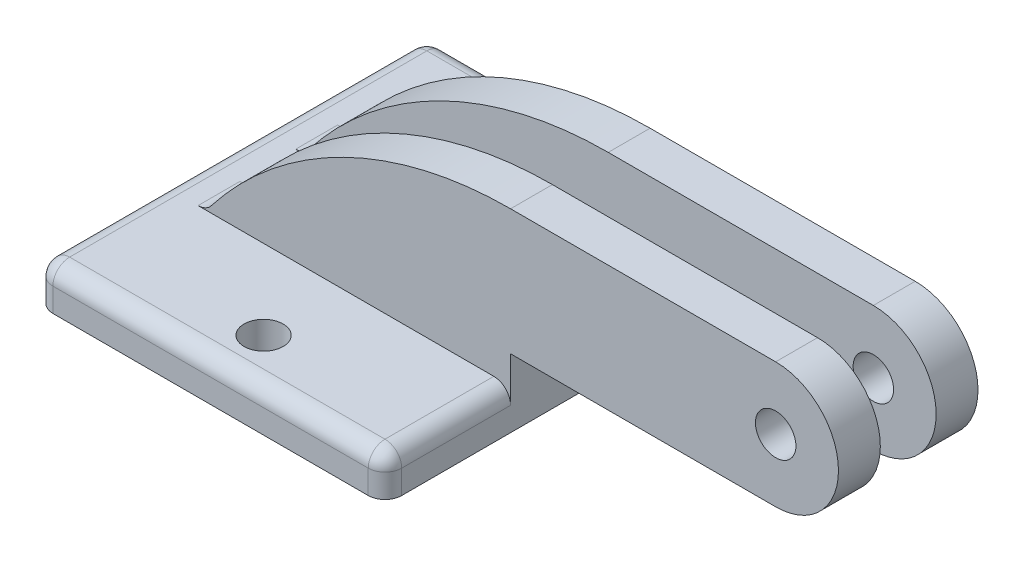
ISO-10303-21;
HEADER;
FILE_DESCRIPTION(('STEP AP214'),'2;1');
FILE_NAME('part.step','',(''),(''),'','','');
FILE_SCHEMA(('AUTOMOTIVE_DESIGN { 1 0 10303 214 1 1 1 1 }'));
ENDSEC;
DATA;
#1=APPLICATION_CONTEXT('core data for automotive mechanical design processes');
#2=APPLICATION_PROTOCOL_DEFINITION('international standard','automotive_design',2000,#1);
#3=PRODUCT_CONTEXT('',#1,'mechanical');
#4=PRODUCT('Part','Part','',(#3));
#5=PRODUCT_RELATED_PRODUCT_CATEGORY('part','',(#4));
#6=PRODUCT_DEFINITION_FORMATION('','',#4);
#7=PRODUCT_DEFINITION_CONTEXT('part definition',#1,'design');
#8=PRODUCT_DEFINITION('design','',#6,#7);
#9=PRODUCT_DEFINITION_SHAPE('','',#8);
#10=(LENGTH_UNIT() NAMED_UNIT(*) SI_UNIT(.MILLI.,.METRE.));
#11=(NAMED_UNIT(*) PLANE_ANGLE_UNIT() SI_UNIT($,.RADIAN.));
#12=(NAMED_UNIT(*) SI_UNIT($,.STERADIAN.) SOLID_ANGLE_UNIT());
#13=UNCERTAINTY_MEASURE_WITH_UNIT(LENGTH_MEASURE(1.E-05),#10,'distance_accuracy_value','');
#14=(GEOMETRIC_REPRESENTATION_CONTEXT(3) GLOBAL_UNCERTAINTY_ASSIGNED_CONTEXT((#13)) GLOBAL_UNIT_ASSIGNED_CONTEXT((#10,
#11,#12)) REPRESENTATION_CONTEXT('',''));
#15=CARTESIAN_POINT('',(0.,0.,0.));
#16=DIRECTION('',(0.,0.,1.));
#17=DIRECTION('',(1.,0.,0.));
#18=AXIS2_PLACEMENT_3D('',#15,#16,#17);
#19=CARTESIAN_POINT('',(7.9375,1.8415,-8.89));
#20=DIRECTION('',(-1.,0.,0.));
#21=DIRECTION('',(0.,0.,1.));
#22=AXIS2_PLACEMENT_3D('',#19,#20,#21);
#23=PLANE('',#22);
#24=DIRECTION('',(0.,0.,-1.));
#25=VECTOR('',#24,1.);
#26=CARTESIAN_POINT('',(7.9375,1.0795,-3.175));
#27=LINE('',#26,#25);
#28=CARTESIAN_POINT('',(7.9375,1.0795,-8.128));
#29=VERTEX_POINT('',#28);
#30=CARTESIAN_POINT('',(7.9375,1.0795,-3.175));
#31=VERTEX_POINT('',#30);
#32=EDGE_CURVE('E289',#29,#31,#27,.F.);
#33=ORIENTED_EDGE('',*,*,#32,.T.);
#34=DIRECTION('',(0.,1.,0.));
#35=VECTOR('',#34,1.);
#36=CARTESIAN_POINT('',(7.9375,0.,-3.175));
#37=LINE('',#36,#35);
#38=CARTESIAN_POINT('',(7.9375,3.1115,-3.175));
#39=VERTEX_POINT('',#38);
#40=EDGE_CURVE('E419',#31,#39,#37,.T.);
#41=ORIENTED_EDGE('',*,*,#40,.T.);
#42=DIRECTION('',(0.,0.,-1.));
#43=VECTOR('',#42,1.);
#44=CARTESIAN_POINT('',(7.9375,3.1115,3.175));
#45=LINE('',#44,#43);
#46=CARTESIAN_POINT('',(7.9375,3.1115,-1.27));
#47=VERTEX_POINT('',#46);
#48=EDGE_CURVE('E237',#47,#39,#45,.T.);
#49=ORIENTED_EDGE('',*,*,#48,.F.);
#50=DIRECTION('',(0.,1.,0.));
#51=VECTOR('',#50,1.);
#52=CARTESIAN_POINT('',(7.9375,0.,-1.27));
#53=LINE('',#52,#51);
#54=CARTESIAN_POINT('',(7.9375,1.8415,-1.27));
#55=VERTEX_POINT('',#54);
#56=EDGE_CURVE('E452',#55,#47,#53,.T.);
#57=ORIENTED_EDGE('',*,*,#56,.F.);
#58=DIRECTION('',(0.,0.,1.));
#59=VECTOR('',#58,1.);
#60=CARTESIAN_POINT('',(7.9375,1.8415,-1.27));
#61=LINE('',#60,#59);
#62=CARTESIAN_POINT('',(7.9375,1.8415,1.27));
#63=VERTEX_POINT('',#62);
#64=EDGE_CURVE('E387',#55,#63,#61,.T.);
#65=ORIENTED_EDGE('',*,*,#64,.T.);
#66=DIRECTION('',(0.,1.,0.));
#67=VECTOR('',#66,1.);
#68=CARTESIAN_POINT('',(7.9375,0.,1.27));
#69=LINE('',#68,#67);
#70=CARTESIAN_POINT('',(7.9375,3.1115,1.27));
#71=VERTEX_POINT('',#70);
#72=EDGE_CURVE('E378',#63,#71,#69,.T.);
#73=ORIENTED_EDGE('',*,*,#72,.T.);
#74=CARTESIAN_POINT('',(7.9375,3.1115,3.175));
#75=VERTEX_POINT('',#74);
#76=EDGE_CURVE('E232',#75,#71,#45,.T.);
#77=ORIENTED_EDGE('',*,*,#76,.F.);
#78=DIRECTION('',(0.,1.,0.));
#79=VECTOR('',#78,1.);
#80=CARTESIAN_POINT('',(7.9375,0.,3.175));
#81=LINE('',#80,#79);
#82=CARTESIAN_POINT('',(7.9375,1.0795,3.175));
#83=VERTEX_POINT('',#82);
#84=EDGE_CURVE('E404',#83,#75,#81,.T.);
#85=ORIENTED_EDGE('',*,*,#84,.F.);
#86=DIRECTION('',(0.,0.,-1.));
#87=VECTOR('',#86,1.);
#88=CARTESIAN_POINT('',(7.9375,1.0795,8.89));
#89=LINE('',#88,#87);
#90=CARTESIAN_POINT('',(7.9375,1.0795,8.128));
#91=VERTEX_POINT('',#90);
#92=EDGE_CURVE('E285',#83,#91,#89,.F.);
#93=ORIENTED_EDGE('',*,*,#92,.T.);
#94=DIRECTION('',(0.,-1.,0.));
#95=VECTOR('',#94,1.);
#96=CARTESIAN_POINT('',(7.9375,1.8415,8.128));
#97=LINE('',#96,#95);
#98=CARTESIAN_POINT('',(7.9375,0.,8.12799999999999));
#99=VERTEX_POINT('',#98);
#100=EDGE_CURVE('E283',#91,#99,#97,.T.);
#101=ORIENTED_EDGE('',*,*,#100,.T.);
#102=DIRECTION('',(0.,0.,-1.));
#103=VECTOR('',#102,1.);
#104=CARTESIAN_POINT('',(7.9375,0.,-8.89));
#105=LINE('',#104,#103);
#106=CARTESIAN_POINT('',(7.9375,0.,-8.128));
#107=VERTEX_POINT('',#106);
#108=EDGE_CURVE('E257',#99,#107,#105,.T.);
#109=ORIENTED_EDGE('',*,*,#108,.T.);
#110=DIRECTION('',(0.,-1.,0.));
#111=VECTOR('',#110,1.);
#112=CARTESIAN_POINT('',(7.9375,1.8415,-8.128));
#113=LINE('',#112,#111);
#114=EDGE_CURVE('E287',#107,#29,#113,.F.);
#115=ORIENTED_EDGE('',*,*,#114,.T.);
#116=EDGE_LOOP('',(#33,#41,#49,#57,#65,#73,#77,#85,#93,#101,#109,#115));
#117=FACE_BOUND('',#116,.T.);
#118=ADVANCED_FACE('F36',(#117),#23,.F.);
#119=CARTESIAN_POINT('',(0.,8.8265,3.175));
#120=DIRECTION('',(0.,-1.,0.));
#121=DIRECTION('',(1.,0.,0.));
#122=AXIS2_PLACEMENT_3D('',#119,#120,#121);
#123=PLANE('',#122);
#124=DIRECTION('',(-1.,0.,0.));
#125=VECTOR('',#124,1.);
#126=CARTESIAN_POINT('',(0.,8.8265,-1.27));
#127=LINE('',#126,#125);
#128=CARTESIAN_POINT('',(20.0025,8.8265,-1.27));
#129=VERTEX_POINT('',#128);
#130=CARTESIAN_POINT('',(7.9375,8.8265,-1.27));
#131=VERTEX_POINT('',#130);
#132=EDGE_CURVE('E205',#129,#131,#127,.T.);
#133=ORIENTED_EDGE('',*,*,#132,.F.);
#134=DIRECTION('',(0.,0.,-1.));
#135=VECTOR('',#134,1.);
#136=CARTESIAN_POINT('',(20.0025,8.8265,3.175));
#137=LINE('',#136,#135);
#138=CARTESIAN_POINT('',(20.0025,8.8265,-3.175));
#139=VERTEX_POINT('',#138);
#140=EDGE_CURVE('E410',#129,#139,#137,.T.);
#141=ORIENTED_EDGE('',*,*,#140,.T.);
#142=DIRECTION('',(-1.,0.,0.));
#143=VECTOR('',#142,1.);
#144=CARTESIAN_POINT('',(0.,8.8265,-3.175));
#145=LINE('',#144,#143);
#146=CARTESIAN_POINT('',(7.9375,8.8265,-3.175));
#147=VERTEX_POINT('',#146);
#148=EDGE_CURVE('E230',#139,#147,#145,.T.);
#149=ORIENTED_EDGE('',*,*,#148,.T.);
#150=DIRECTION('',(0.,0.,-1.));
#151=VECTOR('',#150,1.);
#152=CARTESIAN_POINT('',(7.9375,8.8265,3.175));
#153=LINE('',#152,#151);
#154=EDGE_CURVE('E221',#131,#147,#153,.T.);
#155=ORIENTED_EDGE('',*,*,#154,.F.);
#156=EDGE_LOOP('',(#133,#141,#149,#155));
#157=FACE_BOUND('',#156,.T.);
#158=ADVANCED_FACE('F228',(#157),#123,.F.);
#159=CARTESIAN_POINT('',(7.9375,-8.38315454545456,3.175));
#160=DIRECTION('',(0.,0.,-1.));
#161=DIRECTION('',(-1.,0.,0.));
#162=AXIS2_PLACEMENT_3D('',#159,#160,#161);
#163=CYLINDRICAL_SURFACE('',#162,17.2096545454546);
#164=CARTESIAN_POINT('',(7.9375,-8.38315454545456,-3.175));
#165=DIRECTION('',(0.,0.,1.));
#166=DIRECTION('',(1.,0.,0.));
#167=AXIS2_PLACEMENT_3D('',#164,#165,#166);
#168=CIRCLE('',#167,17.2096545454546);
#169=CARTESIAN_POINT('',(-5.68177206572116,2.13766471797507,-3.175));
#170=VERTEX_POINT('',#169);
#171=EDGE_CURVE('E414',#147,#170,#168,.T.);
#172=ORIENTED_EDGE('',*,*,#171,.T.);
#173=DIRECTION('',(0.,0.,-1.));
#174=VECTOR('',#173,1.);
#175=CARTESIAN_POINT('',(-5.68177206572116,2.13766471797508,3.175));
#176=LINE('',#175,#174);
#177=CARTESIAN_POINT('',(-5.68177206572116,2.13766471797507,-1.27));
#178=VERTEX_POINT('',#177);
#179=EDGE_CURVE('E224',#170,#178,#176,.F.);
#180=ORIENTED_EDGE('',*,*,#179,.T.);
#181=CARTESIAN_POINT('',(7.9375,-8.38315454545456,-1.27));
#182=DIRECTION('',(0.,0.,1.));
#183=DIRECTION('',(1.,0.,0.));
#184=AXIS2_PLACEMENT_3D('',#181,#182,#183);
#185=CIRCLE('',#184,17.2096545454546);
#186=EDGE_CURVE('E209',#131,#178,#185,.T.);
#187=ORIENTED_EDGE('',*,*,#186,.F.);
#188=ORIENTED_EDGE('',*,*,#154,.T.);
#189=EDGE_LOOP('',(#172,#180,#187,#188));
#190=FACE_BOUND('',#189,.T.);
#191=ADVANCED_FACE('F220',(#190),#163,.T.);
#192=CARTESIAN_POINT('',(0.,3.1115,3.175));
#193=DIRECTION('',(0.,1.,0.));
#194=DIRECTION('',(0.,0.,1.));
#195=AXIS2_PLACEMENT_3D('',#192,#193,#194);
#196=PLANE('',#195);
#197=DIRECTION('',(1.,0.,0.));
#198=VECTOR('',#197,1.);
#199=CARTESIAN_POINT('',(0.,3.1115,-1.27));
#200=LINE('',#199,#198);
#201=CARTESIAN_POINT('',(20.0025,3.1115,-1.27));
#202=VERTEX_POINT('',#201);
#203=EDGE_CURVE('E456',#47,#202,#200,.T.);
#204=ORIENTED_EDGE('',*,*,#203,.F.);
#205=ORIENTED_EDGE('',*,*,#48,.T.);
#206=DIRECTION('',(1.,0.,0.));
#207=VECTOR('',#206,1.);
#208=CARTESIAN_POINT('',(0.,3.1115,-3.175));
#209=LINE('',#208,#207);
#210=CARTESIAN_POINT('',(20.0025,3.1115,-3.175));
#211=VERTEX_POINT('',#210);
#212=EDGE_CURVE('E422',#39,#211,#209,.T.);
#213=ORIENTED_EDGE('',*,*,#212,.T.);
#214=DIRECTION('',(0.,0.,-1.));
#215=VECTOR('',#214,1.);
#216=CARTESIAN_POINT('',(20.0025,3.1115,3.175));
#217=LINE('',#216,#215);
#218=EDGE_CURVE('E429',#202,#211,#217,.T.);
#219=ORIENTED_EDGE('',*,*,#218,.F.);
#220=EDGE_LOOP('',(#204,#205,#213,#219));
#221=FACE_BOUND('',#220,.T.);
#222=ADVANCED_FACE('F442',(#221),#196,.F.);
#223=CARTESIAN_POINT('',(20.0025,5.969,3.175));
#224=DIRECTION('',(0.,0.,-1.));
#225=DIRECTION('',(-1.,0.,0.));
#226=AXIS2_PLACEMENT_3D('',#223,#224,#225);
#227=CYLINDRICAL_SURFACE('',#226,0.92075);
#228=CARTESIAN_POINT('',(20.0025,5.969,-3.175));
#229=DIRECTION('',(0.,0.,1.));
#230=DIRECTION('',(1.,0.,0.));
#231=AXIS2_PLACEMENT_3D('',#228,#229,#230);
#232=CIRCLE('',#231,0.92075);
#233=CARTESIAN_POINT('',(20.92325,5.969,-3.175));
#234=VERTEX_POINT('',#233);
#235=EDGE_CURVE('E390',#234,#234,#232,.T.);
#236=ORIENTED_EDGE('',*,*,#235,.F.);
#237=EDGE_LOOP('',(#236));
#238=FACE_BOUND('',#237,.T.);
#239=CARTESIAN_POINT('',(20.0025,5.969,-1.27));
#240=DIRECTION('',(0.,0.,1.));
#241=DIRECTION('',(1.,0.,0.));
#242=AXIS2_PLACEMENT_3D('',#239,#240,#241);
#243=CIRCLE('',#242,0.92075);
#244=CARTESIAN_POINT('',(20.92325,5.969,-1.27));
#245=VERTEX_POINT('',#244);
#246=EDGE_CURVE('E216',#245,#245,#243,.T.);
#247=ORIENTED_EDGE('',*,*,#246,.T.);
#248=EDGE_LOOP('',(#247));
#249=FACE_BOUND('',#248,.T.);
#250=ADVANCED_FACE('F462',(#238,#249),#227,.F.);
#251=CARTESIAN_POINT('',(20.0025,5.969,3.175));
#252=DIRECTION('',(0.,0.,-1.));
#253=DIRECTION('',(-1.,0.,0.));
#254=AXIS2_PLACEMENT_3D('',#251,#252,#253);
#255=CYLINDRICAL_SURFACE('',#254,2.8575);
#256=CARTESIAN_POINT('',(20.0025,5.969,-1.27));
#257=DIRECTION('',(0.,0.,1.));
#258=DIRECTION('',(1.,0.,0.));
#259=AXIS2_PLACEMENT_3D('',#256,#257,#258);
#260=CIRCLE('',#259,2.8575);
#261=EDGE_CURVE('E212',#202,#129,#260,.T.);
#262=ORIENTED_EDGE('',*,*,#261,.F.);
#263=ORIENTED_EDGE('',*,*,#218,.T.);
#264=CARTESIAN_POINT('',(20.0025,5.969,-3.175));
#265=DIRECTION('',(0.,0.,1.));
#266=DIRECTION('',(1.,0.,0.));
#267=AXIS2_PLACEMENT_3D('',#264,#265,#266);
#268=CIRCLE('',#267,2.8575);
#269=EDGE_CURVE('E395',#211,#139,#268,.T.);
#270=ORIENTED_EDGE('',*,*,#269,.T.);
#271=ORIENTED_EDGE('',*,*,#140,.F.);
#272=EDGE_LOOP('',(#262,#263,#270,#271));
#273=FACE_BOUND('',#272,.T.);
#274=ADVANCED_FACE('F437',(#273),#255,.T.);
#275=CARTESIAN_POINT('',(0.,1.8415,0.));
#276=DIRECTION('',(0.,1.,0.));
#277=DIRECTION('',(0.,0.,1.));
#278=AXIS2_PLACEMENT_3D('',#275,#276,#277);
#279=PLANE('',#278);
#280=CARTESIAN_POINT('',(0.317500000000003,1.8415,-6.7945));
#281=DIRECTION('',(0.,1.,0.));
#282=DIRECTION('',(0.,0.,1.));
#283=AXIS2_PLACEMENT_3D('',#280,#281,#282);
#284=CIRCLE('',#283,0.889);
#285=CARTESIAN_POINT('',(0.317500000000003,1.8415,-5.9055));
#286=VERTEX_POINT('',#285);
#287=EDGE_CURVE('E247',#286,#286,#284,.T.);
#288=ORIENTED_EDGE('',*,*,#287,.F.);
#289=EDGE_LOOP('',(#288));
#290=FACE_BOUND('',#289,.T.);
#291=CARTESIAN_POINT('',(0.317500000000003,1.8415,6.7945));
#292=DIRECTION('',(0.,1.,0.));
#293=DIRECTION('',(0.,0.,1.));
#294=AXIS2_PLACEMENT_3D('',#291,#292,#293);
#295=CIRCLE('',#294,0.889);
#296=CARTESIAN_POINT('',(0.317500000000003,1.8415,7.6835));
#297=VERTEX_POINT('',#296);
#298=EDGE_CURVE('E241',#297,#297,#295,.T.);
#299=ORIENTED_EDGE('',*,*,#298,.F.);
#300=EDGE_LOOP('',(#299));
#301=FACE_BOUND('',#300,.T.);
#302=DIRECTION('',(0.,0.,-1.));
#303=VECTOR('',#302,1.);
#304=CARTESIAN_POINT('',(-6.28479900543509,1.8415,0.));
#305=LINE('',#304,#303);
#306=CARTESIAN_POINT('',(-6.28479900543509,1.8415,-1.27));
#307=VERTEX_POINT('',#306);
#308=CARTESIAN_POINT('',(-6.28479900543509,1.8415,-3.175));
#309=VERTEX_POINT('',#308);
#310=EDGE_CURVE('E277',#307,#309,#305,.T.);
#311=ORIENTED_EDGE('',*,*,#310,.T.);
#312=DIRECTION('',(1.,0.,0.));
#313=VECTOR('',#312,1.);
#314=CARTESIAN_POINT('',(0.,1.8415,-3.175));
#315=LINE('',#314,#313);
#316=CARTESIAN_POINT('',(7.1755,1.8415,-3.175));
#317=VERTEX_POINT('',#316);
#318=EDGE_CURVE('E416',#309,#317,#315,.T.);
#319=ORIENTED_EDGE('',*,*,#318,.T.);
#320=DIRECTION('',(0.,0.,-1.));
#321=VECTOR('',#320,1.);
#322=CARTESIAN_POINT('',(7.1755,1.8415,-8.89));
#323=LINE('',#322,#321);
#324=CARTESIAN_POINT('',(7.1755,1.8415,-8.128));
#325=VERTEX_POINT('',#324);
#326=EDGE_CURVE('E269',#317,#325,#323,.T.);
#327=ORIENTED_EDGE('',*,*,#326,.T.);
#328=DIRECTION('',(-1.,0.,0.));
#329=VECTOR('',#328,1.);
#330=CARTESIAN_POINT('',(-7.9375,1.8415,-8.128));
#331=LINE('',#330,#329);
#332=CARTESIAN_POINT('',(-7.1755,1.8415,-8.128));
#333=VERTEX_POINT('',#332);
#334=EDGE_CURVE('E267',#325,#333,#331,.T.);
#335=ORIENTED_EDGE('',*,*,#334,.T.);
#336=DIRECTION('',(0.,0.,1.));
#337=VECTOR('',#336,1.);
#338=CARTESIAN_POINT('',(-7.1755,1.8415,8.89));
#339=LINE('',#338,#337);
#340=CARTESIAN_POINT('',(-7.1755,1.8415,8.128));
#341=VERTEX_POINT('',#340);
#342=EDGE_CURVE('E263',#333,#341,#339,.T.);
#343=ORIENTED_EDGE('',*,*,#342,.T.);
#344=DIRECTION('',(1.,0.,0.));
#345=VECTOR('',#344,1.);
#346=CARTESIAN_POINT('',(7.9375,1.8415,8.128));
#347=LINE('',#346,#345);
#348=CARTESIAN_POINT('',(7.1755,1.8415,8.128));
#349=VERTEX_POINT('',#348);
#350=EDGE_CURVE('E265',#341,#349,#347,.T.);
#351=ORIENTED_EDGE('',*,*,#350,.T.);
#352=DIRECTION('',(0.,0.,-1.));
#353=VECTOR('',#352,1.);
#354=CARTESIAN_POINT('',(7.1755,1.8415,3.175));
#355=LINE('',#354,#353);
#356=CARTESIAN_POINT('',(7.1755,1.8415,3.175));
#357=VERTEX_POINT('',#356);
#358=EDGE_CURVE('E272',#349,#357,#355,.T.);
#359=ORIENTED_EDGE('',*,*,#358,.T.);
#360=DIRECTION('',(1.,0.,0.));
#361=VECTOR('',#360,1.);
#362=CARTESIAN_POINT('',(0.,1.8415,3.175));
#363=LINE('',#362,#361);
#364=CARTESIAN_POINT('',(-6.28479900543509,1.8415,3.175));
#365=VERTEX_POINT('',#364);
#366=EDGE_CURVE('E401',#365,#357,#363,.T.);
#367=ORIENTED_EDGE('',*,*,#366,.F.);
#368=DIRECTION('',(0.,0.,-1.));
#369=VECTOR('',#368,1.);
#370=CARTESIAN_POINT('',(-6.28479900543509,1.8415,0.));
#371=LINE('',#370,#369);
#372=CARTESIAN_POINT('',(-6.28479900543509,1.8415,1.27));
#373=VERTEX_POINT('',#372);
#374=EDGE_CURVE('E274',#365,#373,#371,.T.);
#375=ORIENTED_EDGE('',*,*,#374,.T.);
#376=DIRECTION('',(1.,0.,0.));
#377=VECTOR('',#376,1.);
#378=CARTESIAN_POINT('',(0.,1.8415,1.27));
#379=LINE('',#378,#377);
#380=EDGE_CURVE('E375',#373,#63,#379,.T.);
#381=ORIENTED_EDGE('',*,*,#380,.T.);
#382=ORIENTED_EDGE('',*,*,#64,.F.);
#383=DIRECTION('',(1.,0.,0.));
#384=VECTOR('',#383,1.);
#385=CARTESIAN_POINT('',(0.,1.8415,-1.27));
#386=LINE('',#385,#384);
#387=EDGE_CURVE('E225',#307,#55,#386,.T.);
#388=ORIENTED_EDGE('',*,*,#387,.F.);
#389=EDGE_LOOP('',(#311,#319,#327,#335,#343,#351,#359,#367,#375,#381,#382,#388));
#390=FACE_BOUND('',#389,.T.);
#391=ADVANCED_FACE('F586',(#290,#301,#390),#279,.T.);
#392=CARTESIAN_POINT('',(0.,0.,0.));
#393=DIRECTION('',(0.,1.,0.));
#394=DIRECTION('',(0.,0.,1.));
#395=AXIS2_PLACEMENT_3D('',#392,#393,#394);
#396=PLANE('',#395);
#397=DIRECTION('',(-1.,0.,0.));
#398=VECTOR('',#397,1.);
#399=CARTESIAN_POINT('',(-7.9375,0.,-8.89));
#400=LINE('',#399,#398);
#401=CARTESIAN_POINT('',(7.1755,0.,-8.89));
#402=VERTEX_POINT('',#401);
#403=CARTESIAN_POINT('',(-7.1755,0.,-8.89));
#404=VERTEX_POINT('',#403);
#405=EDGE_CURVE('E260',#402,#404,#400,.T.);
#406=ORIENTED_EDGE('',*,*,#405,.F.);
#407=CARTESIAN_POINT('',(7.1755,0.,-8.128));
#408=DIRECTION('',(0.,1.,0.));
#409=DIRECTION('',(0.,0.,1.));
#410=AXIS2_PLACEMENT_3D('',#407,#408,#409);
#411=CIRCLE('',#410,0.762);
#412=EDGE_CURVE('E314',#402,#107,#411,.F.);
#413=ORIENTED_EDGE('',*,*,#412,.T.);
#414=ORIENTED_EDGE('',*,*,#108,.F.);
#415=CARTESIAN_POINT('',(7.1755,0.,8.128));
#416=DIRECTION('',(0.,1.,0.));
#417=DIRECTION('',(0.,0.,1.));
#418=AXIS2_PLACEMENT_3D('',#415,#416,#417);
#419=CIRCLE('',#418,0.762);
#420=CARTESIAN_POINT('',(7.1755,0.,8.89));
#421=VERTEX_POINT('',#420);
#422=EDGE_CURVE('E310',#99,#421,#419,.F.);
#423=ORIENTED_EDGE('',*,*,#422,.T.);
#424=DIRECTION('',(1.,0.,0.));
#425=VECTOR('',#424,1.);
#426=CARTESIAN_POINT('',(-7.9375,0.,8.89));
#427=LINE('',#426,#425);
#428=CARTESIAN_POINT('',(-7.1755,0.,8.89));
#429=VERTEX_POINT('',#428);
#430=EDGE_CURVE('E254',#429,#421,#427,.T.);
#431=ORIENTED_EDGE('',*,*,#430,.F.);
#432=CARTESIAN_POINT('',(-7.1755,0.,8.128));
#433=DIRECTION('',(0.,1.,0.));
#434=DIRECTION('',(0.,0.,1.));
#435=AXIS2_PLACEMENT_3D('',#432,#433,#434);
#436=CIRCLE('',#435,0.762);
#437=CARTESIAN_POINT('',(-7.9375,0.,8.128));
#438=VERTEX_POINT('',#437);
#439=EDGE_CURVE('E308',#429,#438,#436,.F.);
#440=ORIENTED_EDGE('',*,*,#439,.T.);
#441=DIRECTION('',(0.,0.,1.));
#442=VECTOR('',#441,1.);
#443=CARTESIAN_POINT('',(-7.9375,0.,-8.89));
#444=LINE('',#443,#442);
#445=CARTESIAN_POINT('',(-7.9375,0.,-8.128));
#446=VERTEX_POINT('',#445);
#447=EDGE_CURVE('E250',#446,#438,#444,.T.);
#448=ORIENTED_EDGE('',*,*,#447,.F.);
#449=CARTESIAN_POINT('',(-7.1755,0.,-8.128));
#450=DIRECTION('',(0.,1.,0.));
#451=DIRECTION('',(0.,0.,1.));
#452=AXIS2_PLACEMENT_3D('',#449,#450,#451);
#453=CIRCLE('',#452,0.762);
#454=EDGE_CURVE('E312',#446,#404,#453,.F.);
#455=ORIENTED_EDGE('',*,*,#454,.T.);
#456=EDGE_LOOP('',(#406,#413,#414,#423,#431,#440,#448,#455));
#457=FACE_BOUND('',#456,.T.);
#458=CARTESIAN_POINT('',(0.317500000000003,0.,-6.7945));
#459=DIRECTION('',(0.,1.,0.));
#460=DIRECTION('',(0.,0.,1.));
#461=AXIS2_PLACEMENT_3D('',#458,#459,#460);
#462=CIRCLE('',#461,0.889);
#463=CARTESIAN_POINT('',(0.317500000000003,0.,-5.9055));
#464=VERTEX_POINT('',#463);
#465=EDGE_CURVE('E244',#464,#464,#462,.T.);
#466=ORIENTED_EDGE('',*,*,#465,.T.);
#467=EDGE_LOOP('',(#466));
#468=FACE_BOUND('',#467,.T.);
#469=CARTESIAN_POINT('',(0.317500000000003,0.,6.7945));
#470=DIRECTION('',(0.,1.,0.));
#471=DIRECTION('',(0.,0.,1.));
#472=AXIS2_PLACEMENT_3D('',#469,#470,#471);
#473=CIRCLE('',#472,0.889);
#474=CARTESIAN_POINT('',(0.317500000000003,0.,7.6835));
#475=VERTEX_POINT('',#474);
#476=EDGE_CURVE('E235',#475,#475,#473,.T.);
#477=ORIENTED_EDGE('',*,*,#476,.T.);
#478=EDGE_LOOP('',(#477));
#479=FACE_BOUND('',#478,.T.);
#480=ADVANCED_FACE('F493',(#457,#468,#479),#396,.F.);
#481=CARTESIAN_POINT('',(-7.9375,1.8415,-8.89));
#482=DIRECTION('',(1.,0.,0.));
#483=DIRECTION('',(0.,0.,-1.));
#484=AXIS2_PLACEMENT_3D('',#481,#482,#483);
#485=PLANE('',#484);
#486=DIRECTION('',(0.,0.,1.));
#487=VECTOR('',#486,1.);
#488=CARTESIAN_POINT('',(-7.9375,1.0795,-8.89));
#489=LINE('',#488,#487);
#490=CARTESIAN_POINT('',(-7.9375,1.0795,8.128));
#491=VERTEX_POINT('',#490);
#492=CARTESIAN_POINT('',(-7.9375,1.0795,-8.128));
#493=VERTEX_POINT('',#492);
#494=EDGE_CURVE('E53',#491,#493,#489,.F.);
#495=ORIENTED_EDGE('',*,*,#494,.T.);
#496=DIRECTION('',(0.,-1.,0.));
#497=VECTOR('',#496,1.);
#498=CARTESIAN_POINT('',(-7.9375,1.8415,-8.128));
#499=LINE('',#498,#497);
#500=EDGE_CURVE('E306',#493,#446,#499,.T.);
#501=ORIENTED_EDGE('',*,*,#500,.T.);
#502=ORIENTED_EDGE('',*,*,#447,.T.);
#503=DIRECTION('',(0.,-1.,0.));
#504=VECTOR('',#503,1.);
#505=CARTESIAN_POINT('',(-7.9375,1.8415,8.128));
#506=LINE('',#505,#504);
#507=EDGE_CURVE('E58',#438,#491,#506,.F.);
#508=ORIENTED_EDGE('',*,*,#507,.T.);
#509=EDGE_LOOP('',(#495,#501,#502,#508));
#510=FACE_BOUND('',#509,.T.);
#511=ADVANCED_FACE('F489',(#510),#485,.F.);
#512=CARTESIAN_POINT('',(-7.9375,1.8415,8.89));
#513=DIRECTION('',(0.,0.,-1.));
#514=DIRECTION('',(-1.,0.,0.));
#515=AXIS2_PLACEMENT_3D('',#512,#513,#514);
#516=PLANE('',#515);
#517=ORIENTED_EDGE('',*,*,#430,.T.);
#518=DIRECTION('',(0.,-1.,0.));
#519=VECTOR('',#518,1.);
#520=CARTESIAN_POINT('',(7.1755,1.8415,8.89));
#521=LINE('',#520,#519);
#522=CARTESIAN_POINT('',(7.1755,1.0795,8.89));
#523=VERTEX_POINT('',#522);
#524=EDGE_CURVE('E302',#421,#523,#521,.F.);
#525=ORIENTED_EDGE('',*,*,#524,.T.);
#526=DIRECTION('',(1.,0.,0.));
#527=VECTOR('',#526,1.);
#528=CARTESIAN_POINT('',(-7.9375,1.0795,8.89));
#529=LINE('',#528,#527);
#530=CARTESIAN_POINT('',(-7.1755,1.0795,8.89));
#531=VERTEX_POINT('',#530);
#532=EDGE_CURVE('E300',#523,#531,#529,.F.);
#533=ORIENTED_EDGE('',*,*,#532,.T.);
#534=DIRECTION('',(0.,-1.,0.));
#535=VECTOR('',#534,1.);
#536=CARTESIAN_POINT('',(-7.1755,1.8415,8.89));
#537=LINE('',#536,#535);
#538=EDGE_CURVE('E298',#531,#429,#537,.T.);
#539=ORIENTED_EDGE('',*,*,#538,.T.);
#540=EDGE_LOOP('',(#517,#525,#533,#539));
#541=FACE_BOUND('',#540,.T.);
#542=ADVANCED_FACE('F486',(#541),#516,.F.);
#543=CARTESIAN_POINT('',(-7.9375,1.8415,-8.89));
#544=DIRECTION('',(0.,0.,1.));
#545=DIRECTION('',(1.,0.,0.));
#546=AXIS2_PLACEMENT_3D('',#543,#544,#545);
#547=PLANE('',#546);
#548=DIRECTION('',(-1.,0.,0.));
#549=VECTOR('',#548,1.);
#550=CARTESIAN_POINT('',(7.9375,1.0795,-8.89));
#551=LINE('',#550,#549);
#552=CARTESIAN_POINT('',(-7.1755,1.0795,-8.89));
#553=VERTEX_POINT('',#552);
#554=CARTESIAN_POINT('',(7.1755,1.0795,-8.89));
#555=VERTEX_POINT('',#554);
#556=EDGE_CURVE('E294',#553,#555,#551,.F.);
#557=ORIENTED_EDGE('',*,*,#556,.T.);
#558=DIRECTION('',(0.,-1.,0.));
#559=VECTOR('',#558,1.);
#560=CARTESIAN_POINT('',(7.1755,1.8415,-8.89));
#561=LINE('',#560,#559);
#562=EDGE_CURVE('E296',#555,#402,#561,.T.);
#563=ORIENTED_EDGE('',*,*,#562,.T.);
#564=ORIENTED_EDGE('',*,*,#405,.T.);
#565=DIRECTION('',(0.,-1.,0.));
#566=VECTOR('',#565,1.);
#567=CARTESIAN_POINT('',(-7.1755,1.8415,-8.89));
#568=LINE('',#567,#566);
#569=EDGE_CURVE('E292',#404,#553,#568,.F.);
#570=ORIENTED_EDGE('',*,*,#569,.T.);
#571=EDGE_LOOP('',(#557,#563,#564,#570));
#572=FACE_BOUND('',#571,.T.);
#573=ADVANCED_FACE('F484',(#572),#547,.F.);
#574=CARTESIAN_POINT('',(0.317500000000003,1.8415,-6.7945));
#575=DIRECTION('',(0.,-1.,0.));
#576=DIRECTION('',(0.,0.,-1.));
#577=AXIS2_PLACEMENT_3D('',#574,#575,#576);
#578=CYLINDRICAL_SURFACE('',#577,0.889);
#579=ORIENTED_EDGE('',*,*,#287,.T.);
#580=EDGE_LOOP('',(#579));
#581=FACE_BOUND('',#580,.T.);
#582=ORIENTED_EDGE('',*,*,#465,.F.);
#583=EDGE_LOOP('',(#582));
#584=FACE_BOUND('',#583,.T.);
#585=ADVANCED_FACE('F637',(#581,#584),#578,.F.);
#586=CARTESIAN_POINT('',(0.317500000000003,1.8415,6.7945));
#587=DIRECTION('',(0.,-1.,0.));
#588=DIRECTION('',(0.,0.,-1.));
#589=AXIS2_PLACEMENT_3D('',#586,#587,#588);
#590=CYLINDRICAL_SURFACE('',#589,0.889);
#591=ORIENTED_EDGE('',*,*,#298,.T.);
#592=EDGE_LOOP('',(#591));
#593=FACE_BOUND('',#592,.T.);
#594=ORIENTED_EDGE('',*,*,#476,.F.);
#595=EDGE_LOOP('',(#594));
#596=FACE_BOUND('',#595,.T.);
#597=ADVANCED_FACE('F611',(#593,#596),#590,.F.);
#598=CARTESIAN_POINT('',(20.0025,8.8265,3.175));
#599=VERTEX_POINT('',#598);
#600=CARTESIAN_POINT('',(20.0025,8.8265,1.27));
#601=VERTEX_POINT('',#600);
#602=EDGE_CURVE('E427',#599,#601,#137,.T.);
#603=ORIENTED_EDGE('',*,*,#602,.T.);
#604=DIRECTION('',(-1.,0.,0.));
#605=VECTOR('',#604,1.);
#606=CARTESIAN_POINT('',(0.,8.8265,1.27));
#607=LINE('',#606,#605);
#608=CARTESIAN_POINT('',(7.9375,8.8265,1.27));
#609=VERTEX_POINT('',#608);
#610=EDGE_CURVE('E363',#601,#609,#607,.T.);
#611=ORIENTED_EDGE('',*,*,#610,.T.);
#612=CARTESIAN_POINT('',(7.9375,8.8265,3.175));
#613=VERTEX_POINT('',#612);
#614=EDGE_CURVE('E231',#613,#609,#153,.T.);
#615=ORIENTED_EDGE('',*,*,#614,.F.);
#616=DIRECTION('',(-1.,0.,0.));
#617=VECTOR('',#616,1.);
#618=CARTESIAN_POINT('',(0.,8.8265,3.175));
#619=LINE('',#618,#617);
#620=EDGE_CURVE('E394',#599,#613,#619,.T.);
#621=ORIENTED_EDGE('',*,*,#620,.F.);
#622=EDGE_LOOP('',(#603,#611,#615,#621));
#623=FACE_BOUND('',#622,.T.);
#624=ADVANCED_FACE('F481',(#623),#123,.F.);
#625=CARTESIAN_POINT('',(7.9375,-8.38315454545456,1.27));
#626=DIRECTION('',(0.,0.,1.));
#627=DIRECTION('',(1.,0.,0.));
#628=AXIS2_PLACEMENT_3D('',#625,#626,#627);
#629=CIRCLE('',#628,17.2096545454546);
#630=CARTESIAN_POINT('',(-5.68177206572116,2.13766471797507,1.27));
#631=VERTEX_POINT('',#630);
#632=EDGE_CURVE('E368',#609,#631,#629,.T.);
#633=ORIENTED_EDGE('',*,*,#632,.T.);
#634=DIRECTION('',(0.,0.,-1.));
#635=VECTOR('',#634,1.);
#636=CARTESIAN_POINT('',(-5.68177206572116,2.13766471797508,3.175));
#637=LINE('',#636,#635);
#638=CARTESIAN_POINT('',(-5.68177206572116,2.13766471797507,3.175));
#639=VERTEX_POINT('',#638);
#640=EDGE_CURVE('E281',#631,#639,#637,.F.);
#641=ORIENTED_EDGE('',*,*,#640,.T.);
#642=CARTESIAN_POINT('',(7.9375,-8.38315454545456,3.175));
#643=DIRECTION('',(0.,0.,1.));
#644=DIRECTION('',(1.,0.,0.));
#645=AXIS2_PLACEMENT_3D('',#642,#643,#644);
#646=CIRCLE('',#645,17.2096545454546);
#647=EDGE_CURVE('E398',#613,#639,#646,.T.);
#648=ORIENTED_EDGE('',*,*,#647,.F.);
#649=ORIENTED_EDGE('',*,*,#614,.T.);
#650=EDGE_LOOP('',(#633,#641,#648,#649));
#651=FACE_BOUND('',#650,.T.);
#652=ADVANCED_FACE('F602',(#651),#163,.T.);
#653=ORIENTED_EDGE('',*,*,#76,.T.);
#654=DIRECTION('',(1.,0.,0.));
#655=VECTOR('',#654,1.);
#656=CARTESIAN_POINT('',(0.,3.1115,1.27));
#657=LINE('',#656,#655);
#658=CARTESIAN_POINT('',(20.0025,3.1115,1.27));
#659=VERTEX_POINT('',#658);
#660=EDGE_CURVE('E381',#71,#659,#657,.T.);
#661=ORIENTED_EDGE('',*,*,#660,.T.);
#662=CARTESIAN_POINT('',(20.0025,3.1115,3.175));
#663=VERTEX_POINT('',#662);
#664=EDGE_CURVE('E430',#663,#659,#217,.T.);
#665=ORIENTED_EDGE('',*,*,#664,.F.);
#666=DIRECTION('',(1.,0.,0.));
#667=VECTOR('',#666,1.);
#668=CARTESIAN_POINT('',(0.,3.1115,3.175));
#669=LINE('',#668,#667);
#670=EDGE_CURVE('E406',#75,#663,#669,.T.);
#671=ORIENTED_EDGE('',*,*,#670,.F.);
#672=EDGE_LOOP('',(#653,#661,#665,#671));
#673=FACE_BOUND('',#672,.T.);
#674=ADVANCED_FACE('F595',(#673),#196,.F.);
#675=CARTESIAN_POINT('',(20.0025,5.969,1.27));
#676=DIRECTION('',(0.,0.,1.));
#677=DIRECTION('',(1.,0.,0.));
#678=AXIS2_PLACEMENT_3D('',#675,#676,#677);
#679=CIRCLE('',#678,0.92075);
#680=CARTESIAN_POINT('',(20.92325,5.969,1.27));
#681=VERTEX_POINT('',#680);
#682=EDGE_CURVE('E360',#681,#681,#679,.T.);
#683=ORIENTED_EDGE('',*,*,#682,.F.);
#684=EDGE_LOOP('',(#683));
#685=FACE_BOUND('',#684,.T.);
#686=CARTESIAN_POINT('',(20.0025,5.969,3.175));
#687=DIRECTION('',(0.,0.,1.));
#688=DIRECTION('',(1.,0.,0.));
#689=AXIS2_PLACEMENT_3D('',#686,#687,#688);
#690=CIRCLE('',#689,0.92075);
#691=CARTESIAN_POINT('',(20.92325,5.969,3.175));
#692=VERTEX_POINT('',#691);
#693=EDGE_CURVE('E391',#692,#692,#690,.T.);
#694=ORIENTED_EDGE('',*,*,#693,.T.);
#695=EDGE_LOOP('',(#694));
#696=FACE_BOUND('',#695,.T.);
#697=ADVANCED_FACE('F609',(#685,#696),#227,.F.);
#698=ORIENTED_EDGE('',*,*,#664,.T.);
#699=CARTESIAN_POINT('',(20.0025,5.969,1.27));
#700=DIRECTION('',(0.,0.,1.));
#701=DIRECTION('',(1.,0.,0.));
#702=AXIS2_PLACEMENT_3D('',#699,#700,#701);
#703=CIRCLE('',#702,2.8575);
#704=EDGE_CURVE('E384',#659,#601,#703,.T.);
#705=ORIENTED_EDGE('',*,*,#704,.T.);
#706=ORIENTED_EDGE('',*,*,#602,.F.);
#707=CARTESIAN_POINT('',(20.0025,5.969,3.175));
#708=DIRECTION('',(0.,0.,1.));
#709=DIRECTION('',(1.,0.,0.));
#710=AXIS2_PLACEMENT_3D('',#707,#708,#709);
#711=CIRCLE('',#710,2.8575);
#712=EDGE_CURVE('E408',#663,#599,#711,.T.);
#713=ORIENTED_EDGE('',*,*,#712,.F.);
#714=EDGE_LOOP('',(#698,#705,#706,#713));
#715=FACE_BOUND('',#714,.T.);
#716=ADVANCED_FACE('F599',(#715),#255,.T.);
#717=CARTESIAN_POINT('',(0.,0.,3.175));
#718=DIRECTION('',(0.,0.,1.));
#719=DIRECTION('',(1.,0.,0.));
#720=AXIS2_PLACEMENT_3D('',#717,#718,#719);
#721=PLANE('',#720);
#722=ORIENTED_EDGE('',*,*,#693,.F.);
#723=EDGE_LOOP('',(#722));
#724=FACE_BOUND('',#723,.T.);
#725=ORIENTED_EDGE('',*,*,#620,.T.);
#726=ORIENTED_EDGE('',*,*,#647,.T.);
#727=CARTESIAN_POINT('',(-6.28479900543509,2.6035,3.175));
#728=DIRECTION('',(0.,0.,1.));
#729=DIRECTION('',(1.,0.,0.));
#730=AXIS2_PLACEMENT_3D('',#727,#728,#729);
#731=CIRCLE('',#730,0.762);
#732=EDGE_CURVE('E322',#639,#365,#731,.F.);
#733=ORIENTED_EDGE('',*,*,#732,.T.);
#734=ORIENTED_EDGE('',*,*,#366,.T.);
#735=CARTESIAN_POINT('',(7.1755,1.0795,3.175));
#736=DIRECTION('',(0.,0.,1.));
#737=DIRECTION('',(1.,0.,0.));
#738=AXIS2_PLACEMENT_3D('',#735,#736,#737);
#739=CIRCLE('',#738,0.762);
#740=EDGE_CURVE('E11',#357,#83,#739,.F.);
#741=ORIENTED_EDGE('',*,*,#740,.T.);
#742=ORIENTED_EDGE('',*,*,#84,.T.);
#743=ORIENTED_EDGE('',*,*,#670,.T.);
#744=ORIENTED_EDGE('',*,*,#712,.T.);
#745=EDGE_LOOP('',(#725,#726,#733,#734,#741,#742,#743,#744));
#746=FACE_BOUND('',#745,.T.);
#747=ADVANCED_FACE('F472',(#724,#746),#721,.T.);
#748=CARTESIAN_POINT('',(0.,0.,-3.175));
#749=DIRECTION('',(0.,0.,1.));
#750=DIRECTION('',(1.,0.,0.));
#751=AXIS2_PLACEMENT_3D('',#748,#749,#750);
#752=PLANE('',#751);
#753=ORIENTED_EDGE('',*,*,#235,.T.);
#754=EDGE_LOOP('',(#753));
#755=FACE_BOUND('',#754,.T.);
#756=ORIENTED_EDGE('',*,*,#148,.F.);
#757=ORIENTED_EDGE('',*,*,#269,.F.);
#758=ORIENTED_EDGE('',*,*,#212,.F.);
#759=ORIENTED_EDGE('',*,*,#40,.F.);
#760=CARTESIAN_POINT('',(7.1755,1.0795,-3.175));
#761=DIRECTION('',(0.,0.,1.));
#762=DIRECTION('',(1.,0.,0.));
#763=AXIS2_PLACEMENT_3D('',#760,#761,#762);
#764=CIRCLE('',#763,0.762);
#765=EDGE_CURVE('E45',#31,#317,#764,.T.);
#766=ORIENTED_EDGE('',*,*,#765,.T.);
#767=ORIENTED_EDGE('',*,*,#318,.F.);
#768=CARTESIAN_POINT('',(-6.28479900543509,2.6035,-3.175));
#769=DIRECTION('',(0.,0.,1.));
#770=DIRECTION('',(1.,0.,0.));
#771=AXIS2_PLACEMENT_3D('',#768,#769,#770);
#772=CIRCLE('',#771,0.762);
#773=EDGE_CURVE('E316',#309,#170,#772,.T.);
#774=ORIENTED_EDGE('',*,*,#773,.T.);
#775=ORIENTED_EDGE('',*,*,#171,.F.);
#776=EDGE_LOOP('',(#756,#757,#758,#759,#766,#767,#774,#775));
#777=FACE_BOUND('',#776,.T.);
#778=ADVANCED_FACE('F445',(#755,#777),#752,.F.);
#779=CARTESIAN_POINT('',(0.,0.,-1.27));
#780=DIRECTION('',(0.,0.,1.));
#781=DIRECTION('',(1.,0.,0.));
#782=AXIS2_PLACEMENT_3D('',#779,#780,#781);
#783=PLANE('',#782);
#784=ORIENTED_EDGE('',*,*,#246,.F.);
#785=EDGE_LOOP('',(#784));
#786=FACE_BOUND('',#785,.T.);
#787=ORIENTED_EDGE('',*,*,#132,.T.);
#788=ORIENTED_EDGE('',*,*,#186,.T.);
#789=CARTESIAN_POINT('',(-6.28479900543509,2.6035,-1.27));
#790=DIRECTION('',(0.,0.,1.));
#791=DIRECTION('',(1.,0.,0.));
#792=AXIS2_PLACEMENT_3D('',#789,#790,#791);
#793=CIRCLE('',#792,0.762);
#794=EDGE_CURVE('E318',#178,#307,#793,.F.);
#795=ORIENTED_EDGE('',*,*,#794,.T.);
#796=ORIENTED_EDGE('',*,*,#387,.T.);
#797=ORIENTED_EDGE('',*,*,#56,.T.);
#798=ORIENTED_EDGE('',*,*,#203,.T.);
#799=ORIENTED_EDGE('',*,*,#261,.T.);
#800=EDGE_LOOP('',(#787,#788,#795,#796,#797,#798,#799));
#801=FACE_BOUND('',#800,.T.);
#802=ADVANCED_FACE('F207',(#786,#801),#783,.T.);
#803=CARTESIAN_POINT('',(0.,0.,1.27));
#804=DIRECTION('',(0.,0.,1.));
#805=DIRECTION('',(1.,0.,0.));
#806=AXIS2_PLACEMENT_3D('',#803,#804,#805);
#807=PLANE('',#806);
#808=ORIENTED_EDGE('',*,*,#682,.T.);
#809=EDGE_LOOP('',(#808));
#810=FACE_BOUND('',#809,.T.);
#811=ORIENTED_EDGE('',*,*,#610,.F.);
#812=ORIENTED_EDGE('',*,*,#704,.F.);
#813=ORIENTED_EDGE('',*,*,#660,.F.);
#814=ORIENTED_EDGE('',*,*,#72,.F.);
#815=ORIENTED_EDGE('',*,*,#380,.F.);
#816=CARTESIAN_POINT('',(-6.28479900543509,2.6035,1.27));
#817=DIRECTION('',(0.,0.,1.));
#818=DIRECTION('',(1.,0.,0.));
#819=AXIS2_PLACEMENT_3D('',#816,#817,#818);
#820=CIRCLE('',#819,0.762);
#821=EDGE_CURVE('E320',#373,#631,#820,.T.);
#822=ORIENTED_EDGE('',*,*,#821,.T.);
#823=ORIENTED_EDGE('',*,*,#632,.F.);
#824=EDGE_LOOP('',(#811,#812,#813,#814,#815,#822,#823));
#825=FACE_BOUND('',#824,.T.);
#826=ADVANCED_FACE('F465',(#810,#825),#807,.F.);
#827=CARTESIAN_POINT('',(-6.28479900543509,2.6035,3.175));
#828=DIRECTION('',(0.,0.,-1.));
#829=DIRECTION('',(-1.,0.,0.));
#830=AXIS2_PLACEMENT_3D('',#827,#828,#829);
#831=CYLINDRICAL_SURFACE('',#830,0.762);
#832=ORIENTED_EDGE('',*,*,#794,.F.);
#833=ORIENTED_EDGE('',*,*,#179,.F.);
#834=ORIENTED_EDGE('',*,*,#773,.F.);
#835=ORIENTED_EDGE('',*,*,#310,.F.);
#836=EDGE_LOOP('',(#832,#833,#834,#835));
#837=FACE_BOUND('',#836,.T.);
#838=ADVANCED_FACE('F448',(#837),#831,.F.);
#839=CARTESIAN_POINT('',(-6.28479900543509,2.6035,3.175));
#840=DIRECTION('',(0.,0.,-1.));
#841=DIRECTION('',(-1.,0.,0.));
#842=AXIS2_PLACEMENT_3D('',#839,#840,#841);
#843=CYLINDRICAL_SURFACE('',#842,0.762);
#844=ORIENTED_EDGE('',*,*,#732,.F.);
#845=ORIENTED_EDGE('',*,*,#640,.F.);
#846=ORIENTED_EDGE('',*,*,#821,.F.);
#847=ORIENTED_EDGE('',*,*,#374,.F.);
#848=EDGE_LOOP('',(#844,#845,#846,#847));
#849=FACE_BOUND('',#848,.T.);
#850=ADVANCED_FACE('F496',(#849),#843,.F.);
#851=CARTESIAN_POINT('',(7.1755,1.0795,0.));
#852=DIRECTION('',(0.,0.,1.));
#853=DIRECTION('',(1.,0.,0.));
#854=AXIS2_PLACEMENT_3D('',#851,#852,#853);
#855=CYLINDRICAL_SURFACE('',#854,0.762);
#856=ORIENTED_EDGE('',*,*,#740,.F.);
#857=ORIENTED_EDGE('',*,*,#358,.F.);
#858=CARTESIAN_POINT('',(7.1755,1.0795,8.128));
#859=DIRECTION('',(0.,0.,1.));
#860=DIRECTION('',(0.,-1.,0.));
#861=AXIS2_PLACEMENT_3D('',#858,#859,#860);
#862=CIRCLE('',#861,0.762);
#863=EDGE_CURVE('E40',#91,#349,#862,.T.);
#864=ORIENTED_EDGE('',*,*,#863,.F.);
#865=ORIENTED_EDGE('',*,*,#92,.F.);
#866=EDGE_LOOP('',(#856,#857,#864,#865));
#867=FACE_BOUND('',#866,.T.);
#868=ADVANCED_FACE('F38',(#867),#855,.T.);
#869=CARTESIAN_POINT('',(7.1755,1.8415,8.128));
#870=DIRECTION('',(0.,-1.,0.));
#871=DIRECTION('',(0.,0.,-1.));
#872=AXIS2_PLACEMENT_3D('',#869,#870,#871);
#873=CYLINDRICAL_SURFACE('',#872,0.762);
#874=ORIENTED_EDGE('',*,*,#422,.F.);
#875=ORIENTED_EDGE('',*,*,#100,.F.);
#876=CARTESIAN_POINT('',(7.1755,1.0795,8.128));
#877=DIRECTION('',(0.,1.,0.));
#878=DIRECTION('',(0.,0.,1.));
#879=AXIS2_PLACEMENT_3D('',#876,#877,#878);
#880=CIRCLE('',#879,0.762);
#881=EDGE_CURVE('E354',#523,#91,#880,.T.);
#882=ORIENTED_EDGE('',*,*,#881,.F.);
#883=ORIENTED_EDGE('',*,*,#524,.F.);
#884=EDGE_LOOP('',(#874,#875,#882,#883));
#885=FACE_BOUND('',#884,.T.);
#886=ADVANCED_FACE('F542',(#885),#873,.T.);
#887=CARTESIAN_POINT('',(7.1755,1.0795,8.128));
#888=DIRECTION('',(1.,0.,0.));
#889=DIRECTION('',(0.,0.,-1.));
#890=AXIS2_PLACEMENT_3D('',#887,#888,#889);
#891=SPHERICAL_SURFACE('',#890,0.762);
#892=ORIENTED_EDGE('',*,*,#881,.T.);
#893=ORIENTED_EDGE('',*,*,#863,.T.);
#894=CARTESIAN_POINT('',(7.1755,1.0795,8.128));
#895=DIRECTION('',(1.,0.,0.));
#896=DIRECTION('',(0.,0.,-1.));
#897=AXIS2_PLACEMENT_3D('',#894,#895,#896);
#898=CIRCLE('',#897,0.762);
#899=EDGE_CURVE('E352',#523,#349,#898,.F.);
#900=ORIENTED_EDGE('',*,*,#899,.F.);
#901=EDGE_LOOP('',(#892,#893,#900));
#902=FACE_BOUND('',#901,.T.);
#903=ADVANCED_FACE('F539',(#902),#891,.T.);
#904=CARTESIAN_POINT('',(0.,1.0795,8.128));
#905=DIRECTION('',(-1.,0.,0.));
#906=DIRECTION('',(0.,0.,1.));
#907=AXIS2_PLACEMENT_3D('',#904,#905,#906);
#908=CYLINDRICAL_SURFACE('',#907,0.762);
#909=ORIENTED_EDGE('',*,*,#899,.T.);
#910=ORIENTED_EDGE('',*,*,#350,.F.);
#911=CARTESIAN_POINT('',(-7.1755,1.0795,8.128));
#912=DIRECTION('',(-1.,0.,0.));
#913=DIRECTION('',(0.,0.,1.));
#914=AXIS2_PLACEMENT_3D('',#911,#912,#913);
#915=CIRCLE('',#914,0.762);
#916=EDGE_CURVE('E349',#531,#341,#915,.T.);
#917=ORIENTED_EDGE('',*,*,#916,.F.);
#918=ORIENTED_EDGE('',*,*,#532,.F.);
#919=EDGE_LOOP('',(#909,#910,#917,#918));
#920=FACE_BOUND('',#919,.T.);
#921=ADVANCED_FACE('F535',(#920),#908,.T.);
#922=CARTESIAN_POINT('',(-7.1755,1.8415,8.128));
#923=DIRECTION('',(0.,-1.,0.));
#924=DIRECTION('',(0.,0.,-1.));
#925=AXIS2_PLACEMENT_3D('',#922,#923,#924);
#926=CYLINDRICAL_SURFACE('',#925,0.762);
#927=ORIENTED_EDGE('',*,*,#439,.F.);
#928=ORIENTED_EDGE('',*,*,#538,.F.);
#929=CARTESIAN_POINT('',(-7.1755,1.0795,8.128));
#930=DIRECTION('',(0.,1.,0.));
#931=DIRECTION('',(0.,0.,1.));
#932=AXIS2_PLACEMENT_3D('',#929,#930,#931);
#933=CIRCLE('',#932,0.762);
#934=EDGE_CURVE('E346',#491,#531,#933,.T.);
#935=ORIENTED_EDGE('',*,*,#934,.F.);
#936=ORIENTED_EDGE('',*,*,#507,.F.);
#937=EDGE_LOOP('',(#927,#928,#935,#936));
#938=FACE_BOUND('',#937,.T.);
#939=ADVANCED_FACE('F531',(#938),#926,.T.);
#940=CARTESIAN_POINT('',(-7.1755,1.0795,8.128));
#941=DIRECTION('',(0.,0.,1.));
#942=DIRECTION('',(1.,0.,0.));
#943=AXIS2_PLACEMENT_3D('',#940,#941,#942);
#944=SPHERICAL_SURFACE('',#943,0.762);
#945=ORIENTED_EDGE('',*,*,#934,.T.);
#946=ORIENTED_EDGE('',*,*,#916,.T.);
#947=CARTESIAN_POINT('',(-7.1755,1.0795,8.128));
#948=DIRECTION('',(0.,0.,1.));
#949=DIRECTION('',(1.,0.,0.));
#950=AXIS2_PLACEMENT_3D('',#947,#948,#949);
#951=CIRCLE('',#950,0.762);
#952=EDGE_CURVE('E343',#491,#341,#951,.F.);
#953=ORIENTED_EDGE('',*,*,#952,.F.);
#954=EDGE_LOOP('',(#945,#946,#953));
#955=FACE_BOUND('',#954,.T.);
#956=ADVANCED_FACE('F527',(#955),#944,.T.);
#957=CARTESIAN_POINT('',(-7.1755,1.0795,0.));
#958=DIRECTION('',(0.,0.,-1.));
#959=DIRECTION('',(-1.,0.,0.));
#960=AXIS2_PLACEMENT_3D('',#957,#958,#959);
#961=CYLINDRICAL_SURFACE('',#960,0.762);
#962=ORIENTED_EDGE('',*,*,#952,.T.);
#963=ORIENTED_EDGE('',*,*,#342,.F.);
#964=CARTESIAN_POINT('',(-7.1755,1.0795,-8.128));
#965=DIRECTION('',(0.,0.,-1.));
#966=DIRECTION('',(-1.,0.,0.));
#967=AXIS2_PLACEMENT_3D('',#964,#965,#966);
#968=CIRCLE('',#967,0.762);
#969=EDGE_CURVE('E340',#493,#333,#968,.T.);
#970=ORIENTED_EDGE('',*,*,#969,.F.);
#971=ORIENTED_EDGE('',*,*,#494,.F.);
#972=EDGE_LOOP('',(#962,#963,#970,#971));
#973=FACE_BOUND('',#972,.T.);
#974=ADVANCED_FACE('F523',(#973),#961,.T.);
#975=CARTESIAN_POINT('',(-7.1755,1.8415,-8.128));
#976=DIRECTION('',(0.,-1.,0.));
#977=DIRECTION('',(0.,0.,-1.));
#978=AXIS2_PLACEMENT_3D('',#975,#976,#977);
#979=CYLINDRICAL_SURFACE('',#978,0.762);
#980=ORIENTED_EDGE('',*,*,#454,.F.);
#981=ORIENTED_EDGE('',*,*,#500,.F.);
#982=CARTESIAN_POINT('',(-7.1755,1.0795,-8.128));
#983=DIRECTION('',(0.,1.,0.));
#984=DIRECTION('',(0.,0.,1.));
#985=AXIS2_PLACEMENT_3D('',#982,#983,#984);
#986=CIRCLE('',#985,0.762);
#987=EDGE_CURVE('E337',#553,#493,#986,.T.);
#988=ORIENTED_EDGE('',*,*,#987,.F.);
#989=ORIENTED_EDGE('',*,*,#569,.F.);
#990=EDGE_LOOP('',(#980,#981,#988,#989));
#991=FACE_BOUND('',#990,.T.);
#992=ADVANCED_FACE('F519',(#991),#979,.T.);
#993=CARTESIAN_POINT('',(-7.1755,1.0795,-8.128));
#994=DIRECTION('',(-1.,0.,0.));
#995=DIRECTION('',(0.,0.,1.));
#996=AXIS2_PLACEMENT_3D('',#993,#994,#995);
#997=SPHERICAL_SURFACE('',#996,0.762);
#998=ORIENTED_EDGE('',*,*,#987,.T.);
#999=ORIENTED_EDGE('',*,*,#969,.T.);
#1000=CARTESIAN_POINT('',(-7.1755,1.0795,-8.128));
#1001=DIRECTION('',(-1.,0.,0.));
#1002=DIRECTION('',(0.,0.,1.));
#1003=AXIS2_PLACEMENT_3D('',#1000,#1001,#1002);
#1004=CIRCLE('',#1003,0.762);
#1005=EDGE_CURVE('E334',#553,#333,#1004,.F.);
#1006=ORIENTED_EDGE('',*,*,#1005,.F.);
#1007=EDGE_LOOP('',(#998,#999,#1006));
#1008=FACE_BOUND('',#1007,.T.);
#1009=ADVANCED_FACE('F515',(#1008),#997,.T.);
#1010=CARTESIAN_POINT('',(0.,1.0795,-8.128));
#1011=DIRECTION('',(1.,0.,0.));
#1012=DIRECTION('',(0.,0.,-1.));
#1013=AXIS2_PLACEMENT_3D('',#1010,#1011,#1012);
#1014=CYLINDRICAL_SURFACE('',#1013,0.762);
#1015=ORIENTED_EDGE('',*,*,#1005,.T.);
#1016=ORIENTED_EDGE('',*,*,#334,.F.);
#1017=CARTESIAN_POINT('',(7.1755,1.0795,-8.128));
#1018=DIRECTION('',(1.,0.,0.));
#1019=DIRECTION('',(0.,1.,0.));
#1020=AXIS2_PLACEMENT_3D('',#1017,#1018,#1019);
#1021=CIRCLE('',#1020,0.762);
#1022=EDGE_CURVE('E331',#555,#325,#1021,.T.);
#1023=ORIENTED_EDGE('',*,*,#1022,.F.);
#1024=ORIENTED_EDGE('',*,*,#556,.F.);
#1025=EDGE_LOOP('',(#1015,#1016,#1023,#1024));
#1026=FACE_BOUND('',#1025,.T.);
#1027=ADVANCED_FACE('F511',(#1026),#1014,.T.);
#1028=CARTESIAN_POINT('',(7.1755,1.8415,-8.128));
#1029=DIRECTION('',(0.,-1.,0.));
#1030=DIRECTION('',(0.,0.,-1.));
#1031=AXIS2_PLACEMENT_3D('',#1028,#1029,#1030);
#1032=CYLINDRICAL_SURFACE('',#1031,0.762);
#1033=ORIENTED_EDGE('',*,*,#412,.F.);
#1034=ORIENTED_EDGE('',*,*,#562,.F.);
#1035=CARTESIAN_POINT('',(7.1755,1.0795,-8.128));
#1036=DIRECTION('',(0.,1.,0.));
#1037=DIRECTION('',(0.,0.,1.));
#1038=AXIS2_PLACEMENT_3D('',#1035,#1036,#1037);
#1039=CIRCLE('',#1038,0.762);
#1040=EDGE_CURVE('E328',#29,#555,#1039,.T.);
#1041=ORIENTED_EDGE('',*,*,#1040,.F.);
#1042=ORIENTED_EDGE('',*,*,#114,.F.);
#1043=EDGE_LOOP('',(#1033,#1034,#1041,#1042));
#1044=FACE_BOUND('',#1043,.T.);
#1045=ADVANCED_FACE('F507',(#1044),#1032,.T.);
#1046=CARTESIAN_POINT('',(7.1755,1.0795,-8.128));
#1047=DIRECTION('',(0.,0.,-1.));
#1048=DIRECTION('',(-1.,0.,0.));
#1049=AXIS2_PLACEMENT_3D('',#1046,#1047,#1048);
#1050=SPHERICAL_SURFACE('',#1049,0.762);
#1051=ORIENTED_EDGE('',*,*,#1040,.T.);
#1052=ORIENTED_EDGE('',*,*,#1022,.T.);
#1053=CARTESIAN_POINT('',(7.1755,1.0795,-8.128));
#1054=DIRECTION('',(0.,0.,-1.));
#1055=DIRECTION('',(-1.,0.,0.));
#1056=AXIS2_PLACEMENT_3D('',#1053,#1054,#1055);
#1057=CIRCLE('',#1056,0.762);
#1058=EDGE_CURVE('E326',#29,#325,#1057,.F.);
#1059=ORIENTED_EDGE('',*,*,#1058,.F.);
#1060=EDGE_LOOP('',(#1051,#1052,#1059));
#1061=FACE_BOUND('',#1060,.T.);
#1062=ADVANCED_FACE('F503',(#1061),#1050,.T.);
#1063=CARTESIAN_POINT('',(7.1755,1.0795,0.));
#1064=DIRECTION('',(0.,0.,1.));
#1065=DIRECTION('',(1.,0.,0.));
#1066=AXIS2_PLACEMENT_3D('',#1063,#1064,#1065);
#1067=CYLINDRICAL_SURFACE('',#1066,0.762);
#1068=ORIENTED_EDGE('',*,*,#765,.F.);
#1069=ORIENTED_EDGE('',*,*,#32,.F.);
#1070=ORIENTED_EDGE('',*,*,#1058,.T.);
#1071=ORIENTED_EDGE('',*,*,#326,.F.);
#1072=EDGE_LOOP('',(#1068,#1069,#1070,#1071));
#1073=FACE_BOUND('',#1072,.T.);
#1074=ADVANCED_FACE('F500',(#1073),#1067,.T.);
#1075=CLOSED_SHELL('',(#118,#158,#191,#222,#250,#274,#391,#480,#511,#542,#573,#585,#597,#624,
#652,#674,#697,#716,#747,#778,#802,#826,#838,#850,#868,#886,#903,#921,#939,#956,#974,#992,#1009,
#1027,#1045,#1062,#1074));
#1076=MANIFOLD_SOLID_BREP('B2',#1075);
#1077=ADVANCED_BREP_SHAPE_REPRESENTATION('',(#18,#1076),#14);
#1078=SHAPE_DEFINITION_REPRESENTATION(#9,#1077);
ENDSEC;
END-ISO-10303-21;
